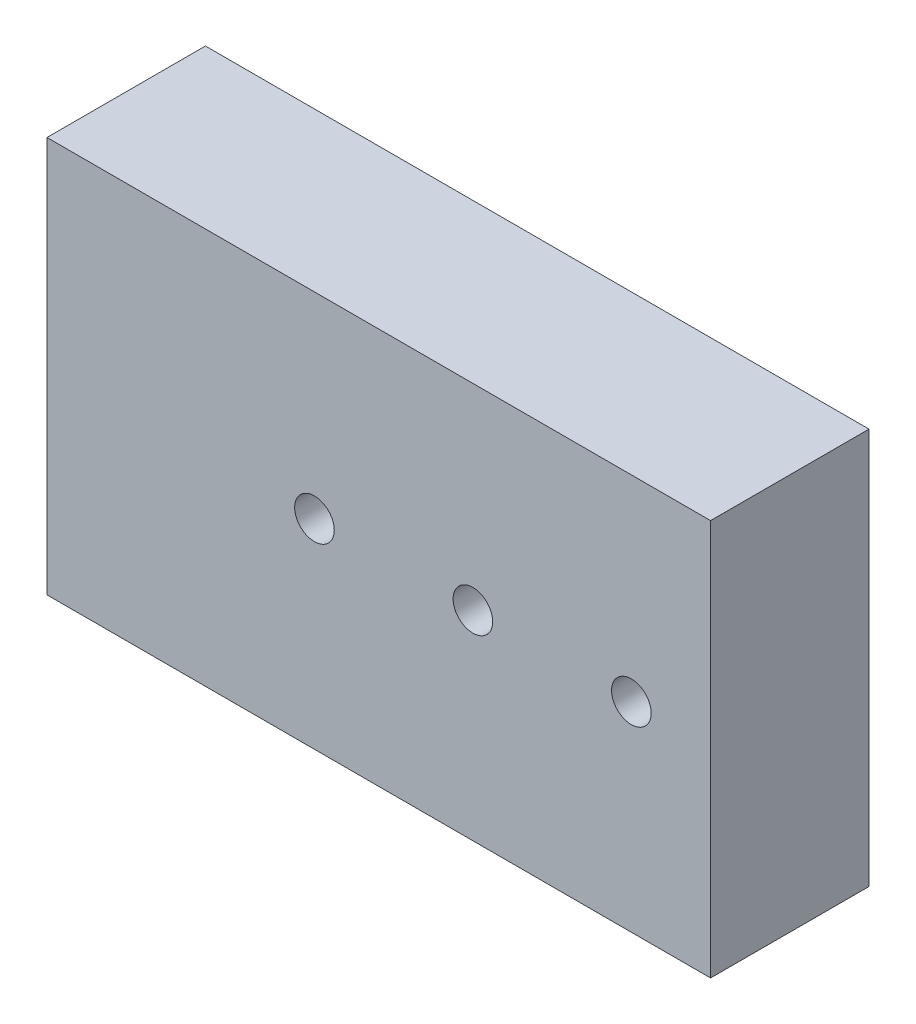
ISO-10303-21;
HEADER;
FILE_DESCRIPTION(('STEP AP214'),'2;1');
FILE_NAME('part.step','',(''),(''),'','','');
FILE_SCHEMA(('AUTOMOTIVE_DESIGN { 1 0 10303 214 1 1 1 1 }'));
ENDSEC;
DATA;
#1=APPLICATION_CONTEXT('core data for automotive mechanical design processes');
#2=APPLICATION_PROTOCOL_DEFINITION('international standard','automotive_design',2000,#1);
#3=PRODUCT_CONTEXT('',#1,'mechanical');
#4=PRODUCT('Part','Part','',(#3));
#5=PRODUCT_RELATED_PRODUCT_CATEGORY('part','',(#4));
#6=PRODUCT_DEFINITION_FORMATION('','',#4);
#7=PRODUCT_DEFINITION_CONTEXT('part definition',#1,'design');
#8=PRODUCT_DEFINITION('design','',#6,#7);
#9=PRODUCT_DEFINITION_SHAPE('','',#8);
#10=(LENGTH_UNIT() NAMED_UNIT(*) SI_UNIT(.MILLI.,.METRE.));
#11=(NAMED_UNIT(*) PLANE_ANGLE_UNIT() SI_UNIT($,.RADIAN.));
#12=(NAMED_UNIT(*) SI_UNIT($,.STERADIAN.) SOLID_ANGLE_UNIT());
#13=UNCERTAINTY_MEASURE_WITH_UNIT(LENGTH_MEASURE(1.E-05),#10,'distance_accuracy_value','');
#14=(GEOMETRIC_REPRESENTATION_CONTEXT(3) GLOBAL_UNCERTAINTY_ASSIGNED_CONTEXT((#13)) GLOBAL_UNIT_ASSIGNED_CONTEXT((#10,
#11,#12)) REPRESENTATION_CONTEXT('',''));
#15=CARTESIAN_POINT('',(0.,0.,0.));
#16=DIRECTION('',(0.,0.,1.));
#17=DIRECTION('',(1.,0.,0.));
#18=AXIS2_PLACEMENT_3D('',#15,#16,#17);
#19=CARTESIAN_POINT('',(174.767553060391,63.5,0.));
#20=DIRECTION('',(0.,1.,0.));
#21=DIRECTION('',(0.,0.,1.));
#22=AXIS2_PLACEMENT_3D('',#19,#20,#21);
#23=PLANE('',#22);
#24=DIRECTION('',(-1.,0.,0.));
#25=VECTOR('',#24,1.);
#26=CARTESIAN_POINT('',(174.767553060391,63.5,0.));
#27=LINE('',#26,#25);
#28=CARTESIAN_POINT('',(106.375960009782,63.5,0.));
#29=VERTEX_POINT('',#28);
#30=CARTESIAN_POINT('',(0.,63.5,0.));
#31=VERTEX_POINT('',#30);
#32=EDGE_CURVE('E74',#29,#31,#27,.T.);
#33=ORIENTED_EDGE('',*,*,#32,.F.);
#34=DIRECTION('',(0.,0.,-1.));
#35=VECTOR('',#34,1.);
#36=CARTESIAN_POINT('',(106.375960009789,63.5,0.));
#37=LINE('',#36,#35);
#38=CARTESIAN_POINT('',(106.375960009789,63.5,-25.4));
#39=VERTEX_POINT('',#38);
#40=EDGE_CURVE('E127',#29,#39,#37,.T.);
#41=ORIENTED_EDGE('',*,*,#40,.T.);
#42=DIRECTION('',(-1.,0.,0.));
#43=VECTOR('',#42,1.);
#44=CARTESIAN_POINT('',(174.767553060391,63.5,-25.4));
#45=LINE('',#44,#43);
#46=CARTESIAN_POINT('',(0.,63.5,-25.4));
#47=VERTEX_POINT('',#46);
#48=EDGE_CURVE('E39',#39,#47,#45,.T.);
#49=ORIENTED_EDGE('',*,*,#48,.T.);
#50=DIRECTION('',(0.,0.,-1.));
#51=VECTOR('',#50,1.);
#52=CARTESIAN_POINT('',(0.,63.5,0.));
#53=LINE('',#52,#51);
#54=EDGE_CURVE('E130',#31,#47,#53,.T.);
#55=ORIENTED_EDGE('',*,*,#54,.F.);
#56=EDGE_LOOP('',(#33,#41,#49,#55));
#57=FACE_BOUND('',#56,.T.);
#58=ADVANCED_FACE('F35',(#57),#23,.T.);
#59=CARTESIAN_POINT('',(174.767553060391,0.,0.));
#60=DIRECTION('',(0.,0.,1.));
#61=DIRECTION('',(1.,0.,0.));
#62=AXIS2_PLACEMENT_3D('',#59,#60,#61);
#63=PLANE('',#62);
#64=CARTESIAN_POINT('',(42.8759600097826,32.0000000000078,0.));
#65=DIRECTION('',(0.,0.,1.));
#66=DIRECTION('',(1.,0.,0.));
#67=AXIS2_PLACEMENT_3D('',#64,#65,#66);
#68=CIRCLE('',#67,3.175);
#69=CARTESIAN_POINT('',(46.0509600097826,32.0000000000078,0.));
#70=VERTEX_POINT('',#69);
#71=EDGE_CURVE('E109',#70,#70,#68,.T.);
#72=ORIENTED_EDGE('',*,*,#71,.F.);
#73=EDGE_LOOP('',(#72));
#74=FACE_BOUND('',#73,.T.);
#75=CARTESIAN_POINT('',(93.6759600097825,31.9999999999963,0.));
#76=DIRECTION('',(0.,0.,1.));
#77=DIRECTION('',(1.,0.,0.));
#78=AXIS2_PLACEMENT_3D('',#75,#76,#77);
#79=CIRCLE('',#78,3.175);
#80=CARTESIAN_POINT('',(96.8509600097825,31.9999999999963,0.));
#81=VERTEX_POINT('',#80);
#82=EDGE_CURVE('E115',#81,#81,#79,.T.);
#83=ORIENTED_EDGE('',*,*,#82,.F.);
#84=EDGE_LOOP('',(#83));
#85=FACE_BOUND('',#84,.T.);
#86=CARTESIAN_POINT('',(68.2759600097826,32.0000000000022,0.));
#87=DIRECTION('',(0.,0.,1.));
#88=DIRECTION('',(1.,0.,0.));
#89=AXIS2_PLACEMENT_3D('',#86,#87,#88);
#90=CIRCLE('',#89,3.175);
#91=CARTESIAN_POINT('',(71.4509600097826,32.0000000000022,0.));
#92=VERTEX_POINT('',#91);
#93=EDGE_CURVE('E121',#92,#92,#90,.T.);
#94=ORIENTED_EDGE('',*,*,#93,.F.);
#95=EDGE_LOOP('',(#94));
#96=FACE_BOUND('',#95,.T.);
#97=DIRECTION('',(-1.,0.,0.));
#98=VECTOR('',#97,1.);
#99=CARTESIAN_POINT('',(174.767553060391,0.,0.));
#100=LINE('',#99,#98);
#101=CARTESIAN_POINT('',(106.375960009775,0.,0.));
#102=VERTEX_POINT('',#101);
#103=CARTESIAN_POINT('',(0.,0.,0.));
#104=VERTEX_POINT('',#103);
#105=EDGE_CURVE('E133',#102,#104,#100,.T.);
#106=ORIENTED_EDGE('',*,*,#105,.F.);
#107=DIRECTION('',(2.20843349431017E-13,1.,0.));
#108=VECTOR('',#107,1.);
#109=CARTESIAN_POINT('',(106.375960009775,1.51038284822209E-11,0.));
#110=LINE('',#109,#108);
#111=EDGE_CURVE('E80',#102,#29,#110,.T.);
#112=ORIENTED_EDGE('',*,*,#111,.T.);
#113=ORIENTED_EDGE('',*,*,#32,.T.);
#114=DIRECTION('',(0.,1.,0.));
#115=VECTOR('',#114,1.);
#116=CARTESIAN_POINT('',(0.,0.,0.));
#117=LINE('',#116,#115);
#118=EDGE_CURVE('E134',#104,#31,#117,.T.);
#119=ORIENTED_EDGE('',*,*,#118,.F.);
#120=EDGE_LOOP('',(#106,#112,#113,#119));
#121=FACE_BOUND('',#120,.T.);
#122=ADVANCED_FACE('F150',(#74,#85,#96,#121),#63,.T.);
#123=CARTESIAN_POINT('',(174.767553060391,0.,0.));
#124=DIRECTION('',(0.,1.,0.));
#125=DIRECTION('',(0.,0.,1.));
#126=AXIS2_PLACEMENT_3D('',#123,#124,#125);
#127=PLANE('',#126);
#128=DIRECTION('',(0.,0.,-1.));
#129=VECTOR('',#128,1.);
#130=CARTESIAN_POINT('',(106.375960009775,0.,0.));
#131=LINE('',#130,#129);
#132=CARTESIAN_POINT('',(106.375960009782,0.,-25.4));
#133=VERTEX_POINT('',#132);
#134=EDGE_CURVE('E44',#102,#133,#131,.T.);
#135=ORIENTED_EDGE('',*,*,#134,.F.);
#136=ORIENTED_EDGE('',*,*,#105,.T.);
#137=DIRECTION('',(0.,0.,-1.));
#138=VECTOR('',#137,1.);
#139=CARTESIAN_POINT('',(0.,0.,0.));
#140=LINE('',#139,#138);
#141=CARTESIAN_POINT('',(0.,0.,-25.4));
#142=VERTEX_POINT('',#141);
#143=EDGE_CURVE('E131',#104,#142,#140,.T.);
#144=ORIENTED_EDGE('',*,*,#143,.T.);
#145=DIRECTION('',(-1.,0.,0.));
#146=VECTOR('',#145,1.);
#147=CARTESIAN_POINT('',(174.767553060391,0.,-25.4));
#148=LINE('',#147,#146);
#149=EDGE_CURVE('E57',#133,#142,#148,.T.);
#150=ORIENTED_EDGE('',*,*,#149,.F.);
#151=EDGE_LOOP('',(#135,#136,#144,#150));
#152=FACE_BOUND('',#151,.T.);
#153=ADVANCED_FACE('F146',(#152),#127,.F.);
#154=CARTESIAN_POINT('',(174.767553060391,0.,-25.4));
#155=DIRECTION('',(0.,0.,1.));
#156=DIRECTION('',(1.,0.,0.));
#157=AXIS2_PLACEMENT_3D('',#154,#155,#156);
#158=PLANE('',#157);
#159=CARTESIAN_POINT('',(42.8759600097826,32.0000000000078,-25.4));
#160=DIRECTION('',(0.,0.,1.));
#161=DIRECTION('',(1.,0.,0.));
#162=AXIS2_PLACEMENT_3D('',#159,#160,#161);
#163=CIRCLE('',#162,3.175);
#164=CARTESIAN_POINT('',(46.0509600097826,32.0000000000078,-25.4));
#165=VERTEX_POINT('',#164);
#166=EDGE_CURVE('E112',#165,#165,#163,.T.);
#167=ORIENTED_EDGE('',*,*,#166,.T.);
#168=EDGE_LOOP('',(#167));
#169=FACE_BOUND('',#168,.T.);
#170=CARTESIAN_POINT('',(93.6759600097825,31.9999999999963,-25.4));
#171=DIRECTION('',(0.,0.,1.));
#172=DIRECTION('',(1.,0.,0.));
#173=AXIS2_PLACEMENT_3D('',#170,#171,#172);
#174=CIRCLE('',#173,3.175);
#175=CARTESIAN_POINT('',(96.8509600097825,31.9999999999963,-25.4));
#176=VERTEX_POINT('',#175);
#177=EDGE_CURVE('E118',#176,#176,#174,.T.);
#178=ORIENTED_EDGE('',*,*,#177,.T.);
#179=EDGE_LOOP('',(#178));
#180=FACE_BOUND('',#179,.T.);
#181=CARTESIAN_POINT('',(68.2759600097826,32.0000000000022,-25.4));
#182=DIRECTION('',(0.,0.,1.));
#183=DIRECTION('',(1.,0.,0.));
#184=AXIS2_PLACEMENT_3D('',#181,#182,#183);
#185=CIRCLE('',#184,3.175);
#186=CARTESIAN_POINT('',(71.4509600097826,32.0000000000022,-25.4));
#187=VERTEX_POINT('',#186);
#188=EDGE_CURVE('E124',#187,#187,#185,.T.);
#189=ORIENTED_EDGE('',*,*,#188,.T.);
#190=EDGE_LOOP('',(#189));
#191=FACE_BOUND('',#190,.T.);
#192=DIRECTION('',(2.20843349431017E-13,1.,0.));
#193=VECTOR('',#192,1.);
#194=CARTESIAN_POINT('',(106.375960009775,1.51038284822209E-11,-25.4));
#195=LINE('',#194,#193);
#196=EDGE_CURVE('E11',#133,#39,#195,.T.);
#197=ORIENTED_EDGE('',*,*,#196,.F.);
#198=ORIENTED_EDGE('',*,*,#149,.T.);
#199=DIRECTION('',(0.,1.,0.));
#200=VECTOR('',#199,1.);
#201=CARTESIAN_POINT('',(0.,0.,-25.4));
#202=LINE('',#201,#200);
#203=EDGE_CURVE('E128',#142,#47,#202,.T.);
#204=ORIENTED_EDGE('',*,*,#203,.T.);
#205=ORIENTED_EDGE('',*,*,#48,.F.);
#206=EDGE_LOOP('',(#197,#198,#204,#205));
#207=FACE_BOUND('',#206,.T.);
#208=ADVANCED_FACE('F158',(#169,#180,#191,#207),#158,.F.);
#209=CARTESIAN_POINT('',(0.,0.,0.));
#210=DIRECTION('',(1.,0.,0.));
#211=DIRECTION('',(0.,0.,-1.));
#212=AXIS2_PLACEMENT_3D('',#209,#210,#211);
#213=PLANE('',#212);
#214=CARTESIAN_POINT('',(0.,7.00000000012637,-15.3999999999979));
#215=DIRECTION('',(-1.,0.,0.));
#216=DIRECTION('',(0.,0.,1.));
#217=AXIS2_PLACEMENT_3D('',#214,#215,#216);
#218=CIRCLE('',#217,3.15);
#219=CARTESIAN_POINT('',(0.,7.00000000012637,-12.2499999999979));
#220=VERTEX_POINT('',#219);
#221=EDGE_CURVE('E99',#220,#220,#218,.T.);
#222=ORIENTED_EDGE('',*,*,#221,.F.);
#223=EDGE_LOOP('',(#222));
#224=FACE_BOUND('',#223,.T.);
#225=CARTESIAN_POINT('',(0.,53.0000000001264,-15.3999999999979));
#226=DIRECTION('',(-1.,0.,0.));
#227=DIRECTION('',(0.,0.,1.));
#228=AXIS2_PLACEMENT_3D('',#225,#226,#227);
#229=CIRCLE('',#228,3.15);
#230=CARTESIAN_POINT('',(0.,53.0000000001264,-12.2499999999979));
#231=VERTEX_POINT('',#230);
#232=EDGE_CURVE('E98',#231,#231,#229,.T.);
#233=ORIENTED_EDGE('',*,*,#232,.F.);
#234=EDGE_LOOP('',(#233));
#235=FACE_BOUND('',#234,.T.);
#236=ORIENTED_EDGE('',*,*,#54,.T.);
#237=ORIENTED_EDGE('',*,*,#203,.F.);
#238=ORIENTED_EDGE('',*,*,#143,.F.);
#239=ORIENTED_EDGE('',*,*,#118,.T.);
#240=EDGE_LOOP('',(#236,#237,#238,#239));
#241=FACE_BOUND('',#240,.T.);
#242=ADVANCED_FACE('F149',(#224,#235,#241),#213,.F.);
#243=CARTESIAN_POINT('',(106.375960009784,38.3245999999938,-922.863280000026));
#244=DIRECTION('',(1.,-2.20843349431017E-13,0.));
#245=DIRECTION('',(0.,0.,1.));
#246=AXIS2_PLACEMENT_3D('',#243,#244,#245);
#247=PLANE('',#246);
#248=ORIENTED_EDGE('',*,*,#40,.F.);
#249=ORIENTED_EDGE('',*,*,#111,.F.);
#250=ORIENTED_EDGE('',*,*,#134,.T.);
#251=ORIENTED_EDGE('',*,*,#196,.T.);
#252=EDGE_LOOP('',(#248,#249,#250,#251));
#253=FACE_BOUND('',#252,.T.);
#254=ADVANCED_FACE('F37',(#253),#247,.T.);
#255=CARTESIAN_POINT('',(68.2759600097826,32.0000000000022,0.));
#256=DIRECTION('',(0.,0.,1.));
#257=DIRECTION('',(1.,0.,0.));
#258=AXIS2_PLACEMENT_3D('',#255,#256,#257);
#259=CYLINDRICAL_SURFACE('',#258,3.175);
#260=ORIENTED_EDGE('',*,*,#188,.F.);
#261=EDGE_LOOP('',(#260));
#262=FACE_BOUND('',#261,.T.);
#263=ORIENTED_EDGE('',*,*,#93,.T.);
#264=EDGE_LOOP('',(#263));
#265=FACE_BOUND('',#264,.T.);
#266=ADVANCED_FACE('F170',(#262,#265),#259,.F.);
#267=CARTESIAN_POINT('',(93.6759600097825,31.9999999999963,0.));
#268=DIRECTION('',(0.,0.,1.));
#269=DIRECTION('',(1.,0.,0.));
#270=AXIS2_PLACEMENT_3D('',#267,#268,#269);
#271=CYLINDRICAL_SURFACE('',#270,3.175);
#272=ORIENTED_EDGE('',*,*,#177,.F.);
#273=EDGE_LOOP('',(#272));
#274=FACE_BOUND('',#273,.T.);
#275=ORIENTED_EDGE('',*,*,#82,.T.);
#276=EDGE_LOOP('',(#275));
#277=FACE_BOUND('',#276,.T.);
#278=ADVANCED_FACE('F173',(#274,#277),#271,.F.);
#279=CARTESIAN_POINT('',(42.8759600097826,32.0000000000078,0.));
#280=DIRECTION('',(0.,0.,1.));
#281=DIRECTION('',(1.,0.,0.));
#282=AXIS2_PLACEMENT_3D('',#279,#280,#281);
#283=CYLINDRICAL_SURFACE('',#282,3.175);
#284=ORIENTED_EDGE('',*,*,#166,.F.);
#285=EDGE_LOOP('',(#284));
#286=FACE_BOUND('',#285,.T.);
#287=ORIENTED_EDGE('',*,*,#71,.T.);
#288=EDGE_LOOP('',(#287));
#289=FACE_BOUND('',#288,.T.);
#290=ADVANCED_FACE('F177',(#286,#289),#283,.F.);
#291=CARTESIAN_POINT('',(9.0000074,53.0000000001264,-15.3999999999979));
#292=DIRECTION('',(-1.,0.,0.));
#293=DIRECTION('',(0.,0.,1.));
#294=AXIS2_PLACEMENT_3D('',#291,#292,#293);
#295=CONICAL_SURFACE('',#294,3.15,1.02974425867665);
#296=CARTESIAN_POINT('',(10.8927183499368,53.0000000001264,-15.3999999999979));
#297=VERTEX_POINT('',#296);
#298=VERTEX_LOOP('',#297);
#299=FACE_BOUND('',#298,.T.);
#300=CARTESIAN_POINT('',(9.0000074,53.0000000001264,-15.3999999999979));
#301=DIRECTION('',(-1.,0.,0.));
#302=DIRECTION('',(0.,0.,1.));
#303=AXIS2_PLACEMENT_3D('',#300,#301,#302);
#304=CIRCLE('',#303,3.15);
#305=CARTESIAN_POINT('',(9.0000074,53.0000000001264,-12.2499999999979));
#306=VERTEX_POINT('',#305);
#307=EDGE_CURVE('E102',#306,#306,#304,.T.);
#308=ORIENTED_EDGE('',*,*,#307,.T.);
#309=EDGE_LOOP('',(#308));
#310=FACE_BOUND('',#309,.T.);
#311=ADVANCED_FACE('F181',(#299,#310),#295,.F.);
#312=CARTESIAN_POINT('',(0.,53.0000000001264,-15.3999999999979));
#313=DIRECTION('',(-1.,0.,0.));
#314=DIRECTION('',(0.,0.,1.));
#315=AXIS2_PLACEMENT_3D('',#312,#313,#314);
#316=CYLINDRICAL_SURFACE('',#315,3.15);
#317=ORIENTED_EDGE('',*,*,#307,.F.);
#318=EDGE_LOOP('',(#317));
#319=FACE_BOUND('',#318,.T.);
#320=ORIENTED_EDGE('',*,*,#232,.T.);
#321=EDGE_LOOP('',(#320));
#322=FACE_BOUND('',#321,.T.);
#323=ADVANCED_FACE('F92',(#319,#322),#316,.F.);
#324=CARTESIAN_POINT('',(9.0000074,7.00000000012637,-15.3999999999979));
#325=DIRECTION('',(-1.,0.,0.));
#326=DIRECTION('',(0.,0.,1.));
#327=AXIS2_PLACEMENT_3D('',#324,#325,#326);
#328=CONICAL_SURFACE('',#327,3.15,1.02974425867665);
#329=CARTESIAN_POINT('',(10.8927183499368,7.00000000012637,-15.3999999999979));
#330=VERTEX_POINT('',#329);
#331=VERTEX_LOOP('',#330);
#332=FACE_BOUND('',#331,.T.);
#333=CARTESIAN_POINT('',(9.0000074,7.00000000012637,-15.3999999999979));
#334=DIRECTION('',(-1.,0.,0.));
#335=DIRECTION('',(0.,0.,1.));
#336=AXIS2_PLACEMENT_3D('',#333,#334,#335);
#337=CIRCLE('',#336,3.15);
#338=CARTESIAN_POINT('',(9.0000074,7.00000000012637,-12.2499999999979));
#339=VERTEX_POINT('',#338);
#340=EDGE_CURVE('E96',#339,#339,#337,.T.);
#341=ORIENTED_EDGE('',*,*,#340,.T.);
#342=EDGE_LOOP('',(#341));
#343=FACE_BOUND('',#342,.T.);
#344=ADVANCED_FACE('F88',(#332,#343),#328,.F.);
#345=CARTESIAN_POINT('',(0.,7.00000000012637,-15.3999999999979));
#346=DIRECTION('',(-1.,0.,0.));
#347=DIRECTION('',(0.,0.,1.));
#348=AXIS2_PLACEMENT_3D('',#345,#346,#347);
#349=CYLINDRICAL_SURFACE('',#348,3.15);
#350=ORIENTED_EDGE('',*,*,#340,.F.);
#351=EDGE_LOOP('',(#350));
#352=FACE_BOUND('',#351,.T.);
#353=ORIENTED_EDGE('',*,*,#221,.T.);
#354=EDGE_LOOP('',(#353));
#355=FACE_BOUND('',#354,.T.);
#356=ADVANCED_FACE('F91',(#352,#355),#349,.F.);
#357=CLOSED_SHELL('',(#58,#122,#153,#208,#242,#254,#266,#278,#290,#311,#323,#344,#356));
#358=MANIFOLD_SOLID_BREP('B2',#357);
#359=ADVANCED_BREP_SHAPE_REPRESENTATION('',(#18,#358),#14);
#360=SHAPE_DEFINITION_REPRESENTATION(#9,#359);
ENDSEC;
END-ISO-10303-21;
